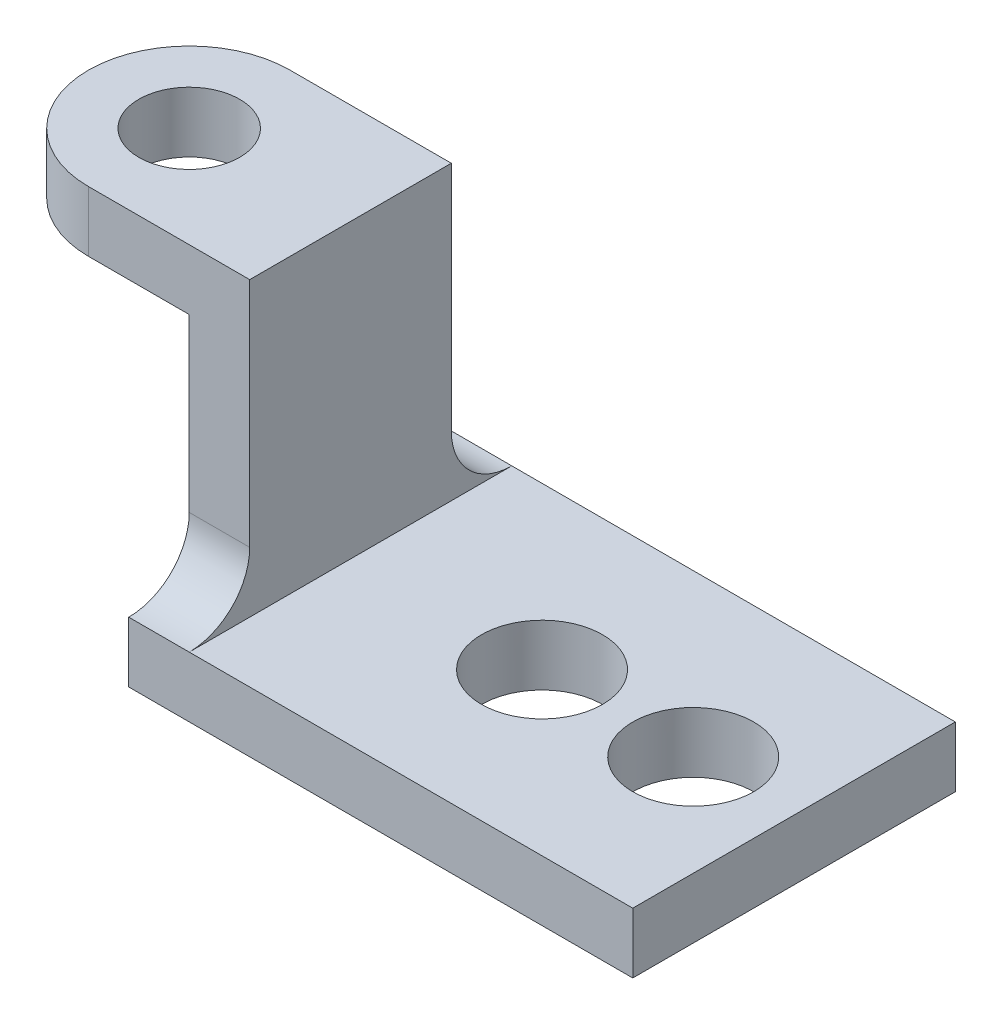
ISO-10303-21;
HEADER;
FILE_DESCRIPTION(('STEP AP214'),'2;1');
FILE_NAME('part.step','',(''),(''),'','','');
FILE_SCHEMA(('AUTOMOTIVE_DESIGN { 1 0 10303 214 1 1 1 1 }'));
ENDSEC;
DATA;
#1=APPLICATION_CONTEXT('core data for automotive mechanical design processes');
#2=APPLICATION_PROTOCOL_DEFINITION('international standard','automotive_design',2000,#1);
#3=PRODUCT_CONTEXT('',#1,'mechanical');
#4=PRODUCT('Part','Part','',(#3));
#5=PRODUCT_RELATED_PRODUCT_CATEGORY('part','',(#4));
#6=PRODUCT_DEFINITION_FORMATION('','',#4);
#7=PRODUCT_DEFINITION_CONTEXT('part definition',#1,'design');
#8=PRODUCT_DEFINITION('design','',#6,#7);
#9=PRODUCT_DEFINITION_SHAPE('','',#8);
#10=(LENGTH_UNIT() NAMED_UNIT(*) SI_UNIT(.MILLI.,.METRE.));
#11=(NAMED_UNIT(*) PLANE_ANGLE_UNIT() SI_UNIT($,.RADIAN.));
#12=(NAMED_UNIT(*) SI_UNIT($,.STERADIAN.) SOLID_ANGLE_UNIT());
#13=UNCERTAINTY_MEASURE_WITH_UNIT(LENGTH_MEASURE(1.E-05),#10,'distance_accuracy_value','');
#14=(GEOMETRIC_REPRESENTATION_CONTEXT(3) GLOBAL_UNCERTAINTY_ASSIGNED_CONTEXT((#13)) GLOBAL_UNIT_ASSIGNED_CONTEXT((#10,
#11,#12)) REPRESENTATION_CONTEXT('',''));
#15=CARTESIAN_POINT('',(0.,0.,0.));
#16=DIRECTION('',(0.,0.,1.));
#17=DIRECTION('',(1.,0.,0.));
#18=AXIS2_PLACEMENT_3D('',#15,#16,#17);
#19=CARTESIAN_POINT('',(0.,58.,32.));
#20=DIRECTION('',(0.,1.,0.));
#21=DIRECTION('',(0.,0.,1.));
#22=AXIS2_PLACEMENT_3D('',#19,#20,#21);
#23=PLANE('',#22);
#24=CARTESIAN_POINT('',(20.,58.,0.));
#25=DIRECTION('',(0.,1.,0.));
#26=DIRECTION('',(0.,0.,1.));
#27=AXIS2_PLACEMENT_3D('',#24,#25,#26);
#28=CIRCLE('',#27,10.);
#29=CARTESIAN_POINT('',(20.,58.,10.));
#30=VERTEX_POINT('',#29);
#31=EDGE_CURVE('E145',#30,#30,#28,.F.);
#32=ORIENTED_EDGE('',*,*,#31,.F.);
#33=EDGE_LOOP('',(#32));
#34=FACE_BOUND('',#33,.T.);
#35=CARTESIAN_POINT('',(20.,58.,0.));
#36=DIRECTION('',(0.,1.,0.));
#37=DIRECTION('',(0.,0.,1.));
#38=AXIS2_PLACEMENT_3D('',#35,#36,#37);
#39=CIRCLE('',#38,20.);
#40=CARTESIAN_POINT('',(20.,58.,-20.));
#41=VERTEX_POINT('',#40);
#42=CARTESIAN_POINT('',(20.,58.,20.));
#43=VERTEX_POINT('',#42);
#44=EDGE_CURVE('E248',#41,#43,#39,.T.);
#45=ORIENTED_EDGE('',*,*,#44,.F.);
#46=DIRECTION('',(1.,0.,0.));
#47=VECTOR('',#46,1.);
#48=CARTESIAN_POINT('',(0.,58.,-20.));
#49=LINE('',#48,#47);
#50=CARTESIAN_POINT('',(40.,58.,-20.));
#51=VERTEX_POINT('',#50);
#52=EDGE_CURVE('E255',#41,#51,#49,.T.);
#53=ORIENTED_EDGE('',*,*,#52,.T.);
#54=DIRECTION('',(0.,0.,-1.));
#55=VECTOR('',#54,1.);
#56=CARTESIAN_POINT('',(40.,58.,32.));
#57=LINE('',#56,#55);
#58=CARTESIAN_POINT('',(40.,58.,20.));
#59=VERTEX_POINT('',#58);
#60=EDGE_CURVE('E178',#59,#51,#57,.T.);
#61=ORIENTED_EDGE('',*,*,#60,.F.);
#62=DIRECTION('',(1.,0.,0.));
#63=VECTOR('',#62,1.);
#64=CARTESIAN_POINT('',(0.,58.,20.));
#65=LINE('',#64,#63);
#66=EDGE_CURVE('E220',#43,#59,#65,.T.);
#67=ORIENTED_EDGE('',*,*,#66,.F.);
#68=EDGE_LOOP('',(#45,#53,#61,#67));
#69=FACE_BOUND('',#68,.T.);
#70=ADVANCED_FACE('F38',(#34,#69),#23,.F.);
#71=CARTESIAN_POINT('',(52.,70.,32.));
#72=DIRECTION('',(-1.,0.,0.));
#73=DIRECTION('',(0.,0.,1.));
#74=AXIS2_PLACEMENT_3D('',#71,#72,#73);
#75=PLANE('',#74);
#76=DIRECTION('',(0.,0.,-1.));
#77=VECTOR('',#76,1.);
#78=CARTESIAN_POINT('',(52.,12.,32.));
#79=LINE('',#78,#77);
#80=CARTESIAN_POINT('',(52.,12.,32.));
#81=VERTEX_POINT('',#80);
#82=CARTESIAN_POINT('',(52.,12.,-32.));
#83=VERTEX_POINT('',#82);
#84=EDGE_CURVE('E152',#81,#83,#79,.T.);
#85=ORIENTED_EDGE('',*,*,#84,.T.);
#86=CARTESIAN_POINT('',(52.,24.,-32.));
#87=DIRECTION('',(-1.,0.,0.));
#88=DIRECTION('',(0.,0.,1.));
#89=AXIS2_PLACEMENT_3D('',#86,#87,#88);
#90=CIRCLE('',#89,12.);
#91=CARTESIAN_POINT('',(52.,24.,-20.));
#92=VERTEX_POINT('',#91);
#93=EDGE_CURVE('E130',#83,#92,#90,.T.);
#94=ORIENTED_EDGE('',*,*,#93,.T.);
#95=DIRECTION('',(0.,1.,0.));
#96=VECTOR('',#95,1.);
#97=CARTESIAN_POINT('',(52.,-49.057350089895,-20.));
#98=LINE('',#97,#96);
#99=CARTESIAN_POINT('',(52.,70.,-20.));
#100=VERTEX_POINT('',#99);
#101=EDGE_CURVE('E123',#92,#100,#98,.T.);
#102=ORIENTED_EDGE('',*,*,#101,.T.);
#103=DIRECTION('',(0.,0.,-1.));
#104=VECTOR('',#103,1.);
#105=CARTESIAN_POINT('',(52.,70.,32.));
#106=LINE('',#105,#104);
#107=CARTESIAN_POINT('',(52.,70.,20.));
#108=VERTEX_POINT('',#107);
#109=EDGE_CURVE('E128',#108,#100,#106,.T.);
#110=ORIENTED_EDGE('',*,*,#109,.F.);
#111=DIRECTION('',(0.,1.,0.));
#112=VECTOR('',#111,1.);
#113=CARTESIAN_POINT('',(52.,-49.057350089895,20.));
#114=LINE('',#113,#112);
#115=CARTESIAN_POINT('',(52.,24.,20.));
#116=VERTEX_POINT('',#115);
#117=EDGE_CURVE('E203',#116,#108,#114,.T.);
#118=ORIENTED_EDGE('',*,*,#117,.F.);
#119=CARTESIAN_POINT('',(52.,24.,32.));
#120=DIRECTION('',(-1.,0.,0.));
#121=DIRECTION('',(0.,0.,1.));
#122=AXIS2_PLACEMENT_3D('',#119,#120,#121);
#123=CIRCLE('',#122,12.);
#124=EDGE_CURVE('E47',#116,#81,#123,.T.);
#125=ORIENTED_EDGE('',*,*,#124,.T.);
#126=EDGE_LOOP('',(#85,#94,#102,#110,#118,#125));
#127=FACE_BOUND('',#126,.T.);
#128=ADVANCED_FACE('F125',(#127),#75,.F.);
#129=CARTESIAN_POINT('',(0.,70.,32.));
#130=DIRECTION('',(0.,-1.,0.));
#131=DIRECTION('',(0.,0.,-1.));
#132=AXIS2_PLACEMENT_3D('',#129,#130,#131);
#133=PLANE('',#132);
#134=CARTESIAN_POINT('',(20.,70.,0.));
#135=DIRECTION('',(0.,1.,0.));
#136=DIRECTION('',(0.,0.,1.));
#137=AXIS2_PLACEMENT_3D('',#134,#135,#136);
#138=CIRCLE('',#137,10.);
#139=CARTESIAN_POINT('',(20.,70.,10.));
#140=VERTEX_POINT('',#139);
#141=EDGE_CURVE('E188',#140,#140,#138,.T.);
#142=ORIENTED_EDGE('',*,*,#141,.F.);
#143=EDGE_LOOP('',(#142));
#144=FACE_BOUND('',#143,.T.);
#145=ORIENTED_EDGE('',*,*,#109,.T.);
#146=DIRECTION('',(1.,0.,0.));
#147=VECTOR('',#146,1.);
#148=CARTESIAN_POINT('',(0.,70.,-20.));
#149=LINE('',#148,#147);
#150=CARTESIAN_POINT('',(20.,70.,-20.));
#151=VERTEX_POINT('',#150);
#152=EDGE_CURVE('E135',#151,#100,#149,.T.);
#153=ORIENTED_EDGE('',*,*,#152,.F.);
#154=CARTESIAN_POINT('',(20.,70.,0.));
#155=DIRECTION('',(0.,1.,0.));
#156=DIRECTION('',(0.,0.,1.));
#157=AXIS2_PLACEMENT_3D('',#154,#155,#156);
#158=CIRCLE('',#157,20.);
#159=CARTESIAN_POINT('',(20.,70.,20.));
#160=VERTEX_POINT('',#159);
#161=EDGE_CURVE('E251',#151,#160,#158,.T.);
#162=ORIENTED_EDGE('',*,*,#161,.T.);
#163=DIRECTION('',(1.,0.,0.));
#164=VECTOR('',#163,1.);
#165=CARTESIAN_POINT('',(0.,70.,20.));
#166=LINE('',#165,#164);
#167=EDGE_CURVE('E150',#160,#108,#166,.T.);
#168=ORIENTED_EDGE('',*,*,#167,.T.);
#169=EDGE_LOOP('',(#145,#153,#162,#168));
#170=FACE_BOUND('',#169,.T.);
#171=ADVANCED_FACE('F148',(#144,#170),#133,.F.);
#172=CARTESIAN_POINT('',(40.,58.,32.));
#173=DIRECTION('',(1.,0.,0.));
#174=DIRECTION('',(0.,0.,-1.));
#175=AXIS2_PLACEMENT_3D('',#172,#173,#174);
#176=PLANE('',#175);
#177=DIRECTION('',(0.,-1.,0.));
#178=VECTOR('',#177,1.);
#179=CARTESIAN_POINT('',(40.,58.,-20.));
#180=LINE('',#179,#178);
#181=CARTESIAN_POINT('',(40.,24.,-20.));
#182=VERTEX_POINT('',#181);
#183=EDGE_CURVE('E265',#51,#182,#180,.T.);
#184=ORIENTED_EDGE('',*,*,#183,.T.);
#185=CARTESIAN_POINT('',(40.,24.,-32.));
#186=DIRECTION('',(1.,0.,0.));
#187=DIRECTION('',(0.,0.,-1.));
#188=AXIS2_PLACEMENT_3D('',#185,#186,#187);
#189=CIRCLE('',#188,12.);
#190=CARTESIAN_POINT('',(40.,12.,-32.));
#191=VERTEX_POINT('',#190);
#192=EDGE_CURVE('E199',#182,#191,#189,.T.);
#193=ORIENTED_EDGE('',*,*,#192,.T.);
#194=DIRECTION('',(0.,-1.,0.));
#195=VECTOR('',#194,1.);
#196=CARTESIAN_POINT('',(40.,58.,-32.));
#197=LINE('',#196,#195);
#198=CARTESIAN_POINT('',(40.,0.,-32.));
#199=VERTEX_POINT('',#198);
#200=EDGE_CURVE('E216',#191,#199,#197,.T.);
#201=ORIENTED_EDGE('',*,*,#200,.T.);
#202=DIRECTION('',(0.,0.,-1.));
#203=VECTOR('',#202,1.);
#204=CARTESIAN_POINT('',(40.,0.,32.));
#205=LINE('',#204,#203);
#206=CARTESIAN_POINT('',(40.,0.,32.));
#207=VERTEX_POINT('',#206);
#208=EDGE_CURVE('E174',#207,#199,#205,.T.);
#209=ORIENTED_EDGE('',*,*,#208,.F.);
#210=DIRECTION('',(0.,-1.,0.));
#211=VECTOR('',#210,1.);
#212=CARTESIAN_POINT('',(40.,58.,32.));
#213=LINE('',#212,#211);
#214=CARTESIAN_POINT('',(40.,12.,32.));
#215=VERTEX_POINT('',#214);
#216=EDGE_CURVE('E234',#215,#207,#213,.T.);
#217=ORIENTED_EDGE('',*,*,#216,.F.);
#218=CARTESIAN_POINT('',(40.,24.,32.));
#219=DIRECTION('',(1.,0.,0.));
#220=DIRECTION('',(0.,0.,-1.));
#221=AXIS2_PLACEMENT_3D('',#218,#219,#220);
#222=CIRCLE('',#221,12.);
#223=CARTESIAN_POINT('',(40.,24.,20.));
#224=VERTEX_POINT('',#223);
#225=EDGE_CURVE('E11',#215,#224,#222,.T.);
#226=ORIENTED_EDGE('',*,*,#225,.T.);
#227=DIRECTION('',(0.,-1.,0.));
#228=VECTOR('',#227,1.);
#229=CARTESIAN_POINT('',(40.,58.,20.));
#230=LINE('',#229,#228);
#231=EDGE_CURVE('E245',#59,#224,#230,.T.);
#232=ORIENTED_EDGE('',*,*,#231,.F.);
#233=ORIENTED_EDGE('',*,*,#60,.T.);
#234=EDGE_LOOP('',(#184,#193,#201,#209,#217,#226,#232,#233));
#235=FACE_BOUND('',#234,.T.);
#236=ADVANCED_FACE('F287',(#235),#176,.F.);
#237=CARTESIAN_POINT('',(40.,0.,32.));
#238=DIRECTION('',(0.,1.,0.));
#239=DIRECTION('',(0.,0.,1.));
#240=AXIS2_PLACEMENT_3D('',#237,#238,#239);
#241=PLANE('',#240);
#242=CARTESIAN_POINT('',(90.,0.,0.));
#243=DIRECTION('',(0.,1.,0.));
#244=DIRECTION('',(0.,0.,1.));
#245=AXIS2_PLACEMENT_3D('',#242,#243,#244);
#246=CIRCLE('',#245,12.);
#247=CARTESIAN_POINT('',(90.,0.,12.));
#248=VERTEX_POINT('',#247);
#249=EDGE_CURVE('E277',#248,#248,#246,.T.);
#250=ORIENTED_EDGE('',*,*,#249,.T.);
#251=EDGE_LOOP('',(#250));
#252=FACE_BOUND('',#251,.T.);
#253=CARTESIAN_POINT('',(120.,0.,0.));
#254=DIRECTION('',(0.,1.,0.));
#255=DIRECTION('',(0.,0.,1.));
#256=AXIS2_PLACEMENT_3D('',#253,#254,#255);
#257=CIRCLE('',#256,12.);
#258=CARTESIAN_POINT('',(120.,0.,12.));
#259=VERTEX_POINT('',#258);
#260=EDGE_CURVE('E273',#259,#259,#257,.T.);
#261=ORIENTED_EDGE('',*,*,#260,.T.);
#262=EDGE_LOOP('',(#261));
#263=FACE_BOUND('',#262,.T.);
#264=DIRECTION('',(1.,0.,0.));
#265=VECTOR('',#264,1.);
#266=CARTESIAN_POINT('',(40.,0.,-32.));
#267=LINE('',#266,#265);
#268=CARTESIAN_POINT('',(140.,0.,-32.));
#269=VERTEX_POINT('',#268);
#270=EDGE_CURVE('E219',#199,#269,#267,.T.);
#271=ORIENTED_EDGE('',*,*,#270,.T.);
#272=DIRECTION('',(0.,0.,-1.));
#273=VECTOR('',#272,1.);
#274=CARTESIAN_POINT('',(140.,0.,32.));
#275=LINE('',#274,#273);
#276=CARTESIAN_POINT('',(140.,0.,32.));
#277=VERTEX_POINT('',#276);
#278=EDGE_CURVE('E170',#277,#269,#275,.T.);
#279=ORIENTED_EDGE('',*,*,#278,.F.);
#280=DIRECTION('',(1.,0.,0.));
#281=VECTOR('',#280,1.);
#282=CARTESIAN_POINT('',(40.,0.,32.));
#283=LINE('',#282,#281);
#284=EDGE_CURVE('E212',#207,#277,#283,.T.);
#285=ORIENTED_EDGE('',*,*,#284,.F.);
#286=ORIENTED_EDGE('',*,*,#208,.T.);
#287=EDGE_LOOP('',(#271,#279,#285,#286));
#288=FACE_BOUND('',#287,.T.);
#289=ADVANCED_FACE('F293',(#252,#263,#288),#241,.F.);
#290=CARTESIAN_POINT('',(140.,12.,32.));
#291=DIRECTION('',(-1.,0.,0.));
#292=DIRECTION('',(0.,0.,1.));
#293=AXIS2_PLACEMENT_3D('',#290,#291,#292);
#294=PLANE('',#293);
#295=DIRECTION('',(0.,1.,0.));
#296=VECTOR('',#295,1.);
#297=CARTESIAN_POINT('',(140.,12.,-32.));
#298=LINE('',#297,#296);
#299=CARTESIAN_POINT('',(140.,12.,-32.));
#300=VERTEX_POINT('',#299);
#301=EDGE_CURVE('E222',#269,#300,#298,.T.);
#302=ORIENTED_EDGE('',*,*,#301,.T.);
#303=DIRECTION('',(0.,0.,-1.));
#304=VECTOR('',#303,1.);
#305=CARTESIAN_POINT('',(140.,12.,32.));
#306=LINE('',#305,#304);
#307=CARTESIAN_POINT('',(140.,12.,32.));
#308=VERTEX_POINT('',#307);
#309=EDGE_CURVE('E157',#308,#300,#306,.T.);
#310=ORIENTED_EDGE('',*,*,#309,.F.);
#311=DIRECTION('',(0.,1.,0.));
#312=VECTOR('',#311,1.);
#313=CARTESIAN_POINT('',(140.,12.,32.));
#314=LINE('',#313,#312);
#315=EDGE_CURVE('E208',#277,#308,#314,.T.);
#316=ORIENTED_EDGE('',*,*,#315,.F.);
#317=ORIENTED_EDGE('',*,*,#278,.T.);
#318=EDGE_LOOP('',(#302,#310,#316,#317));
#319=FACE_BOUND('',#318,.T.);
#320=ADVANCED_FACE('F320',(#319),#294,.F.);
#321=CARTESIAN_POINT('',(52.,12.,32.));
#322=DIRECTION('',(0.,-1.,0.));
#323=DIRECTION('',(1.,0.,0.));
#324=AXIS2_PLACEMENT_3D('',#321,#322,#323);
#325=PLANE('',#324);
#326=CARTESIAN_POINT('',(90.,12.,0.));
#327=DIRECTION('',(0.,-1.,0.));
#328=DIRECTION('',(1.,0.,0.));
#329=AXIS2_PLACEMENT_3D('',#326,#327,#328);
#330=CIRCLE('',#329,12.);
#331=CARTESIAN_POINT('',(102.,12.,0.));
#332=VERTEX_POINT('',#331);
#333=EDGE_CURVE('E187',#332,#332,#330,.F.);
#334=ORIENTED_EDGE('',*,*,#333,.F.);
#335=EDGE_LOOP('',(#334));
#336=FACE_BOUND('',#335,.T.);
#337=CARTESIAN_POINT('',(120.,12.,0.));
#338=DIRECTION('',(0.,-1.,0.));
#339=DIRECTION('',(1.,0.,0.));
#340=AXIS2_PLACEMENT_3D('',#337,#338,#339);
#341=CIRCLE('',#340,12.);
#342=CARTESIAN_POINT('',(132.,12.,0.));
#343=VERTEX_POINT('',#342);
#344=EDGE_CURVE('E183',#343,#343,#341,.F.);
#345=ORIENTED_EDGE('',*,*,#344,.F.);
#346=EDGE_LOOP('',(#345));
#347=FACE_BOUND('',#346,.T.);
#348=DIRECTION('',(-1.,0.,0.));
#349=VECTOR('',#348,1.);
#350=CARTESIAN_POINT('',(52.,12.,-32.));
#351=LINE('',#350,#349);
#352=EDGE_CURVE('E164',#300,#83,#351,.T.);
#353=ORIENTED_EDGE('',*,*,#352,.T.);
#354=ORIENTED_EDGE('',*,*,#84,.F.);
#355=DIRECTION('',(-1.,0.,0.));
#356=VECTOR('',#355,1.);
#357=CARTESIAN_POINT('',(52.,12.,32.));
#358=LINE('',#357,#356);
#359=EDGE_CURVE('E153',#308,#81,#358,.T.);
#360=ORIENTED_EDGE('',*,*,#359,.F.);
#361=ORIENTED_EDGE('',*,*,#309,.T.);
#362=EDGE_LOOP('',(#353,#354,#360,#361));
#363=FACE_BOUND('',#362,.T.);
#364=ADVANCED_FACE('F321',(#336,#347,#363),#325,.F.);
#365=CARTESIAN_POINT('',(0.,0.,32.));
#366=DIRECTION('',(0.,0.,-1.));
#367=DIRECTION('',(-1.,0.,0.));
#368=AXIS2_PLACEMENT_3D('',#365,#366,#367);
#369=PLANE('',#368);
#370=ORIENTED_EDGE('',*,*,#359,.T.);
#371=EDGE_CURVE('E161',#81,#215,#358,.T.);
#372=ORIENTED_EDGE('',*,*,#371,.T.);
#373=ORIENTED_EDGE('',*,*,#216,.T.);
#374=ORIENTED_EDGE('',*,*,#284,.T.);
#375=ORIENTED_EDGE('',*,*,#315,.T.);
#376=EDGE_LOOP('',(#370,#372,#373,#374,#375));
#377=FACE_BOUND('',#376,.T.);
#378=ADVANCED_FACE('F206',(#377),#369,.F.);
#379=CARTESIAN_POINT('',(0.,0.,-32.));
#380=DIRECTION('',(0.,0.,-1.));
#381=DIRECTION('',(-1.,0.,0.));
#382=AXIS2_PLACEMENT_3D('',#379,#380,#381);
#383=PLANE('',#382);
#384=ORIENTED_EDGE('',*,*,#200,.F.);
#385=EDGE_CURVE('E224',#83,#191,#351,.T.);
#386=ORIENTED_EDGE('',*,*,#385,.F.);
#387=ORIENTED_EDGE('',*,*,#352,.F.);
#388=ORIENTED_EDGE('',*,*,#301,.F.);
#389=ORIENTED_EDGE('',*,*,#270,.F.);
#390=EDGE_LOOP('',(#384,#386,#387,#388,#389));
#391=FACE_BOUND('',#390,.T.);
#392=ADVANCED_FACE('F316',(#391),#383,.T.);
#393=CARTESIAN_POINT('',(0.,-49.057350089895,20.));
#394=DIRECTION('',(0.,0.,1.));
#395=DIRECTION('',(1.,0.,0.));
#396=AXIS2_PLACEMENT_3D('',#393,#394,#395);
#397=PLANE('',#396);
#398=ORIENTED_EDGE('',*,*,#231,.T.);
#399=DIRECTION('',(1.,0.,0.));
#400=VECTOR('',#399,1.);
#401=CARTESIAN_POINT('',(0.,24.,20.));
#402=LINE('',#401,#400);
#403=EDGE_CURVE('E194',#224,#116,#402,.T.);
#404=ORIENTED_EDGE('',*,*,#403,.T.);
#405=ORIENTED_EDGE('',*,*,#117,.T.);
#406=ORIENTED_EDGE('',*,*,#167,.F.);
#407=DIRECTION('',(0.,1.,0.));
#408=VECTOR('',#407,1.);
#409=CARTESIAN_POINT('',(20.,-49.057350089895,20.));
#410=LINE('',#409,#408);
#411=EDGE_CURVE('E254',#43,#160,#410,.T.);
#412=ORIENTED_EDGE('',*,*,#411,.F.);
#413=ORIENTED_EDGE('',*,*,#66,.T.);
#414=EDGE_LOOP('',(#398,#404,#405,#406,#412,#413));
#415=FACE_BOUND('',#414,.T.);
#416=ADVANCED_FACE('F357',(#415),#397,.T.);
#417=CARTESIAN_POINT('',(20.,-49.057350089895,0.));
#418=DIRECTION('',(0.,1.,0.));
#419=DIRECTION('',(0.,0.,1.));
#420=AXIS2_PLACEMENT_3D('',#417,#418,#419);
#421=CYLINDRICAL_SURFACE('',#420,20.);
#422=ORIENTED_EDGE('',*,*,#44,.T.);
#423=ORIENTED_EDGE('',*,*,#411,.T.);
#424=ORIENTED_EDGE('',*,*,#161,.F.);
#425=DIRECTION('',(0.,1.,0.));
#426=VECTOR('',#425,1.);
#427=CARTESIAN_POINT('',(20.,-49.057350089895,-20.));
#428=LINE('',#427,#426);
#429=EDGE_CURVE('E134',#41,#151,#428,.T.);
#430=ORIENTED_EDGE('',*,*,#429,.F.);
#431=EDGE_LOOP('',(#422,#423,#424,#430));
#432=FACE_BOUND('',#431,.T.);
#433=ADVANCED_FACE('F352',(#432),#421,.T.);
#434=CARTESIAN_POINT('',(0.,-49.057350089895,-20.));
#435=DIRECTION('',(0.,0.,1.));
#436=DIRECTION('',(1.,0.,0.));
#437=AXIS2_PLACEMENT_3D('',#434,#435,#436);
#438=PLANE('',#437);
#439=ORIENTED_EDGE('',*,*,#101,.F.);
#440=DIRECTION('',(1.,0.,0.));
#441=VECTOR('',#440,1.);
#442=CARTESIAN_POINT('',(40.,24.,-20.));
#443=LINE('',#442,#441);
#444=EDGE_CURVE('E182',#92,#182,#443,.F.);
#445=ORIENTED_EDGE('',*,*,#444,.T.);
#446=ORIENTED_EDGE('',*,*,#183,.F.);
#447=ORIENTED_EDGE('',*,*,#52,.F.);
#448=ORIENTED_EDGE('',*,*,#429,.T.);
#449=ORIENTED_EDGE('',*,*,#152,.T.);
#450=EDGE_LOOP('',(#439,#445,#446,#447,#448,#449));
#451=FACE_BOUND('',#450,.T.);
#452=ADVANCED_FACE('F139',(#451),#438,.F.);
#453=CARTESIAN_POINT('',(120.,70.,0.));
#454=DIRECTION('',(0.,-1.,0.));
#455=DIRECTION('',(0.,0.,-1.));
#456=AXIS2_PLACEMENT_3D('',#453,#454,#455);
#457=CYLINDRICAL_SURFACE('',#456,12.);
#458=ORIENTED_EDGE('',*,*,#260,.F.);
#459=EDGE_LOOP('',(#458));
#460=FACE_BOUND('',#459,.T.);
#461=ORIENTED_EDGE('',*,*,#344,.T.);
#462=EDGE_LOOP('',(#461));
#463=FACE_BOUND('',#462,.T.);
#464=ADVANCED_FACE('F341',(#460,#463),#457,.F.);
#465=CARTESIAN_POINT('',(90.,70.,0.));
#466=DIRECTION('',(0.,-1.,0.));
#467=DIRECTION('',(0.,0.,-1.));
#468=AXIS2_PLACEMENT_3D('',#465,#466,#467);
#469=CYLINDRICAL_SURFACE('',#468,12.);
#470=ORIENTED_EDGE('',*,*,#249,.F.);
#471=EDGE_LOOP('',(#470));
#472=FACE_BOUND('',#471,.T.);
#473=ORIENTED_EDGE('',*,*,#333,.T.);
#474=EDGE_LOOP('',(#473));
#475=FACE_BOUND('',#474,.T.);
#476=ADVANCED_FACE('F311',(#472,#475),#469,.F.);
#477=CARTESIAN_POINT('',(20.,70.,0.));
#478=DIRECTION('',(0.,-1.,0.));
#479=DIRECTION('',(0.,0.,-1.));
#480=AXIS2_PLACEMENT_3D('',#477,#478,#479);
#481=CYLINDRICAL_SURFACE('',#480,10.);
#482=ORIENTED_EDGE('',*,*,#141,.T.);
#483=EDGE_LOOP('',(#482));
#484=FACE_BOUND('',#483,.T.);
#485=ORIENTED_EDGE('',*,*,#31,.T.);
#486=EDGE_LOOP('',(#485));
#487=FACE_BOUND('',#486,.T.);
#488=ADVANCED_FACE('F283',(#484,#487),#481,.F.);
#489=CARTESIAN_POINT('',(52.,24.,-32.));
#490=DIRECTION('',(-1.,0.,0.));
#491=DIRECTION('',(0.,0.,1.));
#492=AXIS2_PLACEMENT_3D('',#489,#490,#491);
#493=CYLINDRICAL_SURFACE('',#492,12.);
#494=ORIENTED_EDGE('',*,*,#192,.F.);
#495=ORIENTED_EDGE('',*,*,#444,.F.);
#496=ORIENTED_EDGE('',*,*,#93,.F.);
#497=ORIENTED_EDGE('',*,*,#385,.T.);
#498=EDGE_LOOP('',(#494,#495,#496,#497));
#499=FACE_BOUND('',#498,.T.);
#500=ADVANCED_FACE('F305',(#499),#493,.F.);
#501=CARTESIAN_POINT('',(0.,24.,32.));
#502=DIRECTION('',(1.,0.,0.));
#503=DIRECTION('',(0.,1.,0.));
#504=AXIS2_PLACEMENT_3D('',#501,#502,#503);
#505=CYLINDRICAL_SURFACE('',#504,12.);
#506=ORIENTED_EDGE('',*,*,#225,.F.);
#507=ORIENTED_EDGE('',*,*,#371,.F.);
#508=ORIENTED_EDGE('',*,*,#124,.F.);
#509=ORIENTED_EDGE('',*,*,#403,.F.);
#510=EDGE_LOOP('',(#506,#507,#508,#509));
#511=FACE_BOUND('',#510,.T.);
#512=ADVANCED_FACE('F40',(#511),#505,.F.);
#513=CLOSED_SHELL('',(#70,#128,#171,#236,#289,#320,#364,#378,#392,#416,#433,#452,#464,#476,#488,
#500,#512));
#514=MANIFOLD_SOLID_BREP('B2',#513);
#515=ADVANCED_BREP_SHAPE_REPRESENTATION('',(#18,#514),#14);
#516=SHAPE_DEFINITION_REPRESENTATION(#9,#515);
ENDSEC;
END-ISO-10303-21;
